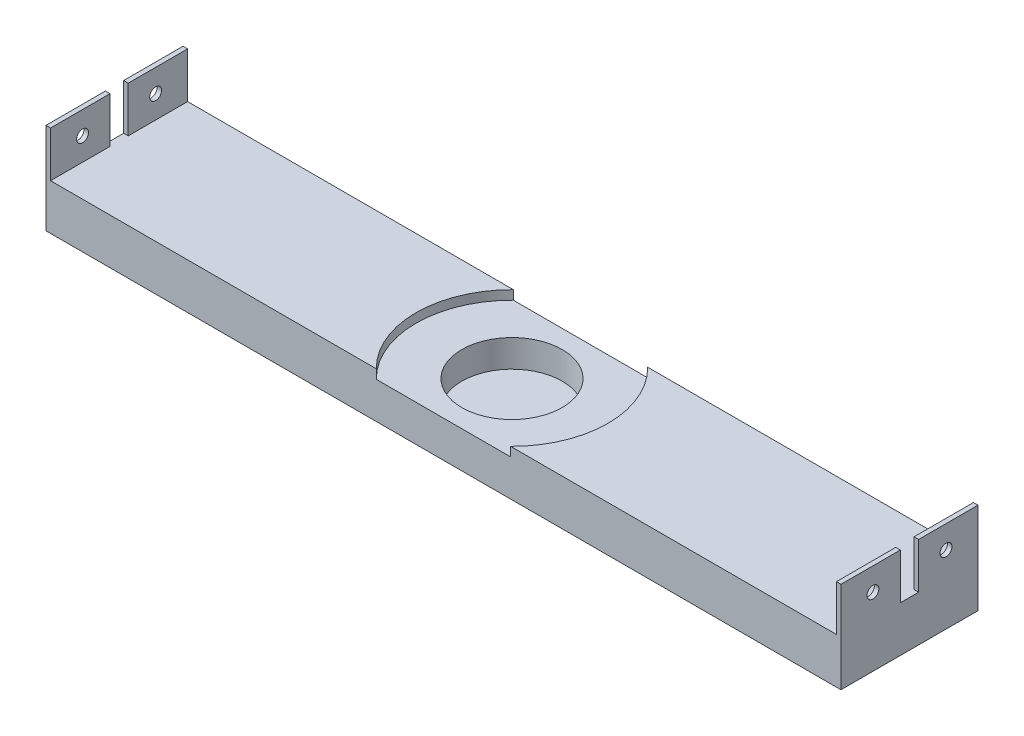
ISO-10303-21;
HEADER;
FILE_DESCRIPTION(('STEP AP214'),'2;1');
FILE_NAME('part.step','',(''),(''),'','','');
FILE_SCHEMA(('AUTOMOTIVE_DESIGN { 1 0 10303 214 1 1 1 1 }'));
ENDSEC;
DATA;
#1=APPLICATION_CONTEXT('core data for automotive mechanical design processes');
#2=APPLICATION_PROTOCOL_DEFINITION('international standard','automotive_design',2000,#1);
#3=PRODUCT_CONTEXT('',#1,'mechanical');
#4=PRODUCT('Part','Part','',(#3));
#5=PRODUCT_RELATED_PRODUCT_CATEGORY('part','',(#4));
#6=PRODUCT_DEFINITION_FORMATION('','',#4);
#7=PRODUCT_DEFINITION_CONTEXT('part definition',#1,'design');
#8=PRODUCT_DEFINITION('design','',#6,#7);
#9=PRODUCT_DEFINITION_SHAPE('','',#8);
#10=(LENGTH_UNIT() NAMED_UNIT(*) SI_UNIT(.MILLI.,.METRE.));
#11=(NAMED_UNIT(*) PLANE_ANGLE_UNIT() SI_UNIT($,.RADIAN.));
#12=(NAMED_UNIT(*) SI_UNIT($,.STERADIAN.) SOLID_ANGLE_UNIT());
#13=UNCERTAINTY_MEASURE_WITH_UNIT(LENGTH_MEASURE(1.E-05),#10,'distance_accuracy_value','');
#14=(GEOMETRIC_REPRESENTATION_CONTEXT(3) GLOBAL_UNCERTAINTY_ASSIGNED_CONTEXT((#13)) GLOBAL_UNIT_ASSIGNED_CONTEXT((#10,
#11,#12)) REPRESENTATION_CONTEXT('',''));
#15=CARTESIAN_POINT('',(0.,0.,0.));
#16=DIRECTION('',(0.,0.,1.));
#17=DIRECTION('',(1.,0.,0.));
#18=AXIS2_PLACEMENT_3D('',#15,#16,#17);
#19=CARTESIAN_POINT('',(86.,10.,30.));
#20=DIRECTION('',(0.,-1.,0.));
#21=DIRECTION('',(1.,0.,0.));
#22=AXIS2_PLACEMENT_3D('',#19,#20,#21);
#23=PLANE('',#22);
#24=DIRECTION('',(-1.,0.,0.));
#25=VECTOR('',#24,1.);
#26=CARTESIAN_POINT('',(86.,10.,30.));
#27=LINE('',#26,#25);
#28=CARTESIAN_POINT('',(-14.6969384566991,10.,30.));
#29=VERTEX_POINT('',#28);
#30=CARTESIAN_POINT('',(-86.,10.,30.));
#31=VERTEX_POINT('',#30);
#32=EDGE_CURVE('E185',#29,#31,#27,.T.);
#33=ORIENTED_EDGE('',*,*,#32,.F.);
#34=CARTESIAN_POINT('',(0.,10.,15.));
#35=DIRECTION('',(0.,1.,0.));
#36=DIRECTION('',(-1.,0.,0.));
#37=AXIS2_PLACEMENT_3D('',#34,#35,#36);
#38=CIRCLE('',#37,21.);
#39=CARTESIAN_POINT('',(-14.6969384566991,10.,0.));
#40=VERTEX_POINT('',#39);
#41=EDGE_CURVE('E169',#40,#29,#38,.T.);
#42=ORIENTED_EDGE('',*,*,#41,.F.);
#43=DIRECTION('',(-1.,0.,0.));
#44=VECTOR('',#43,1.);
#45=CARTESIAN_POINT('',(86.,10.,0.));
#46=LINE('',#45,#44);
#47=CARTESIAN_POINT('',(-86.,10.,0.));
#48=VERTEX_POINT('',#47);
#49=EDGE_CURVE('E222',#40,#48,#46,.T.);
#50=ORIENTED_EDGE('',*,*,#49,.T.);
#51=DIRECTION('',(0.,0.,-1.));
#52=VECTOR('',#51,1.);
#53=CARTESIAN_POINT('',(-86.,10.,30.));
#54=LINE('',#53,#52);
#55=CARTESIAN_POINT('',(-86.,10.,13.));
#56=VERTEX_POINT('',#55);
#57=EDGE_CURVE('E233',#56,#48,#54,.T.);
#58=ORIENTED_EDGE('',*,*,#57,.F.);
#59=DIRECTION('',(-1.,0.,0.));
#60=VECTOR('',#59,1.);
#61=CARTESIAN_POINT('',(87.,9.99999999999999,13.));
#62=LINE('',#61,#60);
#63=CARTESIAN_POINT('',(-87.,9.99999999999999,13.));
#64=VERTEX_POINT('',#63);
#65=EDGE_CURVE('E292',#56,#64,#62,.T.);
#66=ORIENTED_EDGE('',*,*,#65,.T.);
#67=DIRECTION('',(0.,0.,-1.));
#68=VECTOR('',#67,1.);
#69=CARTESIAN_POINT('',(-87.,9.99999999999999,30.));
#70=LINE('',#69,#68);
#71=CARTESIAN_POINT('',(-87.,9.99999999999999,17.));
#72=VERTEX_POINT('',#71);
#73=EDGE_CURVE('E304',#72,#64,#70,.T.);
#74=ORIENTED_EDGE('',*,*,#73,.F.);
#75=DIRECTION('',(-1.,0.,0.));
#76=VECTOR('',#75,1.);
#77=CARTESIAN_POINT('',(87.,9.99999999999999,17.));
#78=LINE('',#77,#76);
#79=CARTESIAN_POINT('',(-86.,9.99999999999999,17.));
#80=VERTEX_POINT('',#79);
#81=EDGE_CURVE('E367',#80,#72,#78,.T.);
#82=ORIENTED_EDGE('',*,*,#81,.F.);
#83=EDGE_CURVE('E192',#31,#80,#54,.T.);
#84=ORIENTED_EDGE('',*,*,#83,.F.);
#85=EDGE_LOOP('',(#33,#42,#50,#58,#66,#74,#82,#84));
#86=FACE_BOUND('',#85,.T.);
#87=ADVANCED_FACE('F33',(#86),#23,.F.);
#88=CARTESIAN_POINT('',(-86.,20.,30.));
#89=DIRECTION('',(0.,-1.,0.));
#90=DIRECTION('',(0.,0.,-1.));
#91=AXIS2_PLACEMENT_3D('',#88,#89,#90);
#92=PLANE('',#91);
#93=DIRECTION('',(0.,0.,-1.));
#94=VECTOR('',#93,1.);
#95=CARTESIAN_POINT('',(-86.,20.,30.));
#96=LINE('',#95,#94);
#97=CARTESIAN_POINT('',(-86.,20.,30.));
#98=VERTEX_POINT('',#97);
#99=CARTESIAN_POINT('',(-86.,20.,17.));
#100=VERTEX_POINT('',#99);
#101=EDGE_CURVE('E230',#98,#100,#96,.T.);
#102=ORIENTED_EDGE('',*,*,#101,.T.);
#103=DIRECTION('',(-1.,0.,0.));
#104=VECTOR('',#103,1.);
#105=CARTESIAN_POINT('',(87.,20.,17.));
#106=LINE('',#105,#104);
#107=CARTESIAN_POINT('',(-87.,20.,17.));
#108=VERTEX_POINT('',#107);
#109=EDGE_CURVE('E365',#100,#108,#106,.T.);
#110=ORIENTED_EDGE('',*,*,#109,.T.);
#111=DIRECTION('',(0.,0.,-1.));
#112=VECTOR('',#111,1.);
#113=CARTESIAN_POINT('',(-87.,20.,30.));
#114=LINE('',#113,#112);
#115=CARTESIAN_POINT('',(-87.,20.,30.));
#116=VERTEX_POINT('',#115);
#117=EDGE_CURVE('E254',#116,#108,#114,.T.);
#118=ORIENTED_EDGE('',*,*,#117,.F.);
#119=DIRECTION('',(-1.,0.,0.));
#120=VECTOR('',#119,1.);
#121=CARTESIAN_POINT('',(-86.,20.,30.));
#122=LINE('',#121,#120);
#123=EDGE_CURVE('E229',#98,#116,#122,.T.);
#124=ORIENTED_EDGE('',*,*,#123,.F.);
#125=EDGE_LOOP('',(#102,#110,#118,#124));
#126=FACE_BOUND('',#125,.T.);
#127=ADVANCED_FACE('F381',(#126),#92,.F.);
#128=CARTESIAN_POINT('',(86.,20.,30.));
#129=DIRECTION('',(0.,-1.,0.));
#130=DIRECTION('',(0.,0.,-1.));
#131=AXIS2_PLACEMENT_3D('',#128,#129,#130);
#132=PLANE('',#131);
#133=DIRECTION('',(0.,0.,-1.));
#134=VECTOR('',#133,1.);
#135=CARTESIAN_POINT('',(87.,20.,30.));
#136=LINE('',#135,#134);
#137=CARTESIAN_POINT('',(87.,20.,30.));
#138=VERTEX_POINT('',#137);
#139=CARTESIAN_POINT('',(87.,20.,17.));
#140=VERTEX_POINT('',#139);
#141=EDGE_CURVE('E244',#138,#140,#136,.T.);
#142=ORIENTED_EDGE('',*,*,#141,.T.);
#143=CARTESIAN_POINT('',(86.,20.,17.));
#144=VERTEX_POINT('',#143);
#145=EDGE_CURVE('E308',#140,#144,#106,.T.);
#146=ORIENTED_EDGE('',*,*,#145,.T.);
#147=DIRECTION('',(0.,0.,-1.));
#148=VECTOR('',#147,1.);
#149=CARTESIAN_POINT('',(86.,20.,30.));
#150=LINE('',#149,#148);
#151=CARTESIAN_POINT('',(86.,20.,30.));
#152=VERTEX_POINT('',#151);
#153=EDGE_CURVE('E240',#152,#144,#150,.T.);
#154=ORIENTED_EDGE('',*,*,#153,.F.);
#155=DIRECTION('',(-1.,0.,0.));
#156=VECTOR('',#155,1.);
#157=CARTESIAN_POINT('',(86.,20.,30.));
#158=LINE('',#157,#156);
#159=EDGE_CURVE('E199',#138,#152,#158,.T.);
#160=ORIENTED_EDGE('',*,*,#159,.F.);
#161=EDGE_LOOP('',(#142,#146,#154,#160));
#162=FACE_BOUND('',#161,.T.);
#163=ADVANCED_FACE('F349',(#162),#132,.F.);
#164=CARTESIAN_POINT('',(86.,10.,30.));
#165=DIRECTION('',(1.,0.,0.));
#166=DIRECTION('',(0.,0.,-1.));
#167=AXIS2_PLACEMENT_3D('',#164,#165,#166);
#168=PLANE('',#167);
#169=CARTESIAN_POINT('',(86.,15.,23.));
#170=DIRECTION('',(1.,0.,0.));
#171=DIRECTION('',(0.,0.,-1.));
#172=AXIS2_PLACEMENT_3D('',#169,#170,#171);
#173=CIRCLE('',#172,1.3);
#174=CARTESIAN_POINT('',(86.,15.,21.7));
#175=VERTEX_POINT('',#174);
#176=EDGE_CURVE('E261',#175,#175,#173,.T.);
#177=ORIENTED_EDGE('',*,*,#176,.T.);
#178=EDGE_LOOP('',(#177));
#179=FACE_BOUND('',#178,.T.);
#180=ORIENTED_EDGE('',*,*,#153,.T.);
#181=DIRECTION('',(0.,-1.,0.));
#182=VECTOR('',#181,1.);
#183=CARTESIAN_POINT('',(86.,10.,17.));
#184=LINE('',#183,#182);
#185=CARTESIAN_POINT('',(86.,9.99999999999999,17.));
#186=VERTEX_POINT('',#185);
#187=EDGE_CURVE('E312',#144,#186,#184,.T.);
#188=ORIENTED_EDGE('',*,*,#187,.T.);
#189=DIRECTION('',(0.,0.,-1.));
#190=VECTOR('',#189,1.);
#191=CARTESIAN_POINT('',(86.,10.,30.));
#192=LINE('',#191,#190);
#193=CARTESIAN_POINT('',(86.,10.,30.));
#194=VERTEX_POINT('',#193);
#195=EDGE_CURVE('E236',#194,#186,#192,.T.);
#196=ORIENTED_EDGE('',*,*,#195,.F.);
#197=DIRECTION('',(0.,-1.,0.));
#198=VECTOR('',#197,1.);
#199=CARTESIAN_POINT('',(86.,10.,30.));
#200=LINE('',#199,#198);
#201=EDGE_CURVE('E195',#152,#194,#200,.T.);
#202=ORIENTED_EDGE('',*,*,#201,.F.);
#203=EDGE_LOOP('',(#180,#188,#196,#202));
#204=FACE_BOUND('',#203,.T.);
#205=ADVANCED_FACE('F351',(#179,#204),#168,.F.);
#206=CARTESIAN_POINT('',(-86.,10.,30.));
#207=DIRECTION('',(-1.,0.,0.));
#208=DIRECTION('',(0.,0.,1.));
#209=AXIS2_PLACEMENT_3D('',#206,#207,#208);
#210=PLANE('',#209);
#211=CARTESIAN_POINT('',(-86.,15.,23.));
#212=DIRECTION('',(-1.,0.,0.));
#213=DIRECTION('',(0.,0.,1.));
#214=AXIS2_PLACEMENT_3D('',#211,#212,#213);
#215=CIRCLE('',#214,1.3);
#216=CARTESIAN_POINT('',(-86.,15.,24.3));
#217=VERTEX_POINT('',#216);
#218=EDGE_CURVE('E258',#217,#217,#215,.T.);
#219=ORIENTED_EDGE('',*,*,#218,.T.);
#220=EDGE_LOOP('',(#219));
#221=FACE_BOUND('',#220,.T.);
#222=ORIENTED_EDGE('',*,*,#83,.T.);
#223=DIRECTION('',(0.,1.,0.));
#224=VECTOR('',#223,1.);
#225=CARTESIAN_POINT('',(-86.,10.,17.));
#226=LINE('',#225,#224);
#227=EDGE_CURVE('E270',#80,#100,#226,.T.);
#228=ORIENTED_EDGE('',*,*,#227,.T.);
#229=ORIENTED_EDGE('',*,*,#101,.F.);
#230=DIRECTION('',(0.,1.,0.));
#231=VECTOR('',#230,1.);
#232=CARTESIAN_POINT('',(-86.,10.,30.));
#233=LINE('',#232,#231);
#234=EDGE_CURVE('E198',#31,#98,#233,.T.);
#235=ORIENTED_EDGE('',*,*,#234,.F.);
#236=EDGE_LOOP('',(#222,#228,#229,#235));
#237=FACE_BOUND('',#236,.T.);
#238=ADVANCED_FACE('F385',(#221,#237),#210,.F.);
#239=CARTESIAN_POINT('',(-87.,20.,13.));
#240=VERTEX_POINT('',#239);
#241=CARTESIAN_POINT('',(-87.,20.,0.));
#242=VERTEX_POINT('',#241);
#243=EDGE_CURVE('E253',#240,#242,#114,.T.);
#244=ORIENTED_EDGE('',*,*,#243,.F.);
#245=DIRECTION('',(-1.,0.,0.));
#246=VECTOR('',#245,1.);
#247=CARTESIAN_POINT('',(87.,20.,13.));
#248=LINE('',#247,#246);
#249=CARTESIAN_POINT('',(-86.,20.,13.));
#250=VERTEX_POINT('',#249);
#251=EDGE_CURVE('E290',#250,#240,#248,.T.);
#252=ORIENTED_EDGE('',*,*,#251,.F.);
#253=CARTESIAN_POINT('',(-86.,20.,0.));
#254=VERTEX_POINT('',#253);
#255=EDGE_CURVE('E204',#250,#254,#96,.T.);
#256=ORIENTED_EDGE('',*,*,#255,.T.);
#257=DIRECTION('',(-1.,0.,0.));
#258=VECTOR('',#257,1.);
#259=CARTESIAN_POINT('',(-86.,20.,0.));
#260=LINE('',#259,#258);
#261=EDGE_CURVE('E205',#254,#242,#260,.T.);
#262=ORIENTED_EDGE('',*,*,#261,.T.);
#263=EDGE_LOOP('',(#244,#252,#256,#262));
#264=FACE_BOUND('',#263,.T.);
#265=ADVANCED_FACE('F35',(#264),#92,.F.);
#266=CARTESIAN_POINT('',(-87.,20.,30.));
#267=DIRECTION('',(1.,0.,0.));
#268=DIRECTION('',(0.,0.,-1.));
#269=AXIS2_PLACEMENT_3D('',#266,#267,#268);
#270=PLANE('',#269);
#271=CARTESIAN_POINT('',(-87.,15.,7.));
#272=DIRECTION('',(1.,0.,0.));
#273=DIRECTION('',(0.,0.,-1.));
#274=AXIS2_PLACEMENT_3D('',#271,#272,#273);
#275=CIRCLE('',#274,1.3);
#276=CARTESIAN_POINT('',(-87.,15.,5.7));
#277=VERTEX_POINT('',#276);
#278=EDGE_CURVE('E267',#277,#277,#275,.F.);
#279=ORIENTED_EDGE('',*,*,#278,.F.);
#280=EDGE_LOOP('',(#279));
#281=FACE_BOUND('',#280,.T.);
#282=CARTESIAN_POINT('',(-87.,15.,23.));
#283=DIRECTION('',(1.,0.,0.));
#284=DIRECTION('',(0.,0.,-1.));
#285=AXIS2_PLACEMENT_3D('',#282,#283,#284);
#286=CIRCLE('',#285,1.3);
#287=CARTESIAN_POINT('',(-87.,15.,21.7));
#288=VERTEX_POINT('',#287);
#289=EDGE_CURVE('E262',#288,#288,#286,.T.);
#290=ORIENTED_EDGE('',*,*,#289,.T.);
#291=EDGE_LOOP('',(#290));
#292=FACE_BOUND('',#291,.T.);
#293=ORIENTED_EDGE('',*,*,#117,.T.);
#294=DIRECTION('',(0.,-1.,0.));
#295=VECTOR('',#294,1.);
#296=CARTESIAN_POINT('',(-87.,20.,17.));
#297=LINE('',#296,#295);
#298=EDGE_CURVE('E315',#108,#72,#297,.T.);
#299=ORIENTED_EDGE('',*,*,#298,.T.);
#300=ORIENTED_EDGE('',*,*,#73,.T.);
#301=DIRECTION('',(0.,1.,0.));
#302=VECTOR('',#301,1.);
#303=CARTESIAN_POINT('',(-87.,20.,13.));
#304=LINE('',#303,#302);
#305=EDGE_CURVE('E310',#64,#240,#304,.T.);
#306=ORIENTED_EDGE('',*,*,#305,.T.);
#307=ORIENTED_EDGE('',*,*,#243,.T.);
#308=DIRECTION('',(0.,-1.,0.));
#309=VECTOR('',#308,1.);
#310=CARTESIAN_POINT('',(-87.,20.,0.));
#311=LINE('',#310,#309);
#312=CARTESIAN_POINT('',(-87.,0.,0.));
#313=VERTEX_POINT('',#312);
#314=EDGE_CURVE('E208',#242,#313,#311,.T.);
#315=ORIENTED_EDGE('',*,*,#314,.T.);
#316=DIRECTION('',(0.,0.,-1.));
#317=VECTOR('',#316,1.);
#318=CARTESIAN_POINT('',(-87.,0.,30.));
#319=LINE('',#318,#317);
#320=CARTESIAN_POINT('',(-87.,0.,30.));
#321=VERTEX_POINT('',#320);
#322=EDGE_CURVE('E250',#321,#313,#319,.T.);
#323=ORIENTED_EDGE('',*,*,#322,.F.);
#324=DIRECTION('',(0.,-1.,0.));
#325=VECTOR('',#324,1.);
#326=CARTESIAN_POINT('',(-87.,20.,30.));
#327=LINE('',#326,#325);
#328=EDGE_CURVE('E336',#116,#321,#327,.T.);
#329=ORIENTED_EDGE('',*,*,#328,.F.);
#330=EDGE_LOOP('',(#293,#299,#300,#306,#307,#315,#323,#329));
#331=FACE_BOUND('',#330,.T.);
#332=ADVANCED_FACE('F377',(#281,#292,#331),#270,.F.);
#333=CARTESIAN_POINT('',(-87.,0.,30.));
#334=DIRECTION('',(0.,1.,0.));
#335=DIRECTION('',(-1.,0.,0.));
#336=AXIS2_PLACEMENT_3D('',#333,#334,#335);
#337=PLANE('',#336);
#338=DIRECTION('',(1.,0.,0.));
#339=VECTOR('',#338,1.);
#340=CARTESIAN_POINT('',(-87.,0.,0.));
#341=LINE('',#340,#339);
#342=CARTESIAN_POINT('',(87.,0.,0.));
#343=VERTEX_POINT('',#342);
#344=EDGE_CURVE('E211',#313,#343,#341,.T.);
#345=ORIENTED_EDGE('',*,*,#344,.T.);
#346=DIRECTION('',(0.,0.,-1.));
#347=VECTOR('',#346,1.);
#348=CARTESIAN_POINT('',(87.,0.,30.));
#349=LINE('',#348,#347);
#350=CARTESIAN_POINT('',(87.,0.,30.));
#351=VERTEX_POINT('',#350);
#352=EDGE_CURVE('E247',#351,#343,#349,.T.);
#353=ORIENTED_EDGE('',*,*,#352,.F.);
#354=DIRECTION('',(1.,0.,0.));
#355=VECTOR('',#354,1.);
#356=CARTESIAN_POINT('',(-87.,0.,30.));
#357=LINE('',#356,#355);
#358=EDGE_CURVE('E338',#321,#351,#357,.T.);
#359=ORIENTED_EDGE('',*,*,#358,.F.);
#360=ORIENTED_EDGE('',*,*,#322,.T.);
#361=EDGE_LOOP('',(#345,#353,#359,#360));
#362=FACE_BOUND('',#361,.T.);
#363=ADVANCED_FACE('F392',(#362),#337,.F.);
#364=CARTESIAN_POINT('',(87.,20.,30.));
#365=DIRECTION('',(-1.,0.,0.));
#366=DIRECTION('',(0.,0.,1.));
#367=AXIS2_PLACEMENT_3D('',#364,#365,#366);
#368=PLANE('',#367);
#369=CARTESIAN_POINT('',(87.,15.,7.));
#370=DIRECTION('',(-1.,0.,0.));
#371=DIRECTION('',(0.,0.,1.));
#372=AXIS2_PLACEMENT_3D('',#369,#370,#371);
#373=CIRCLE('',#372,1.3);
#374=CARTESIAN_POINT('',(87.,15.,8.3));
#375=VERTEX_POINT('',#374);
#376=EDGE_CURVE('E322',#375,#375,#373,.F.);
#377=ORIENTED_EDGE('',*,*,#376,.F.);
#378=EDGE_LOOP('',(#377));
#379=FACE_BOUND('',#378,.T.);
#380=CARTESIAN_POINT('',(87.,15.,23.));
#381=DIRECTION('',(-1.,0.,0.));
#382=DIRECTION('',(0.,0.,1.));
#383=AXIS2_PLACEMENT_3D('',#380,#381,#382);
#384=CIRCLE('',#383,1.3);
#385=CARTESIAN_POINT('',(87.,15.,24.3));
#386=VERTEX_POINT('',#385);
#387=EDGE_CURVE('E329',#386,#386,#384,.T.);
#388=ORIENTED_EDGE('',*,*,#387,.T.);
#389=EDGE_LOOP('',(#388));
#390=FACE_BOUND('',#389,.T.);
#391=DIRECTION('',(0.,0.,1.));
#392=VECTOR('',#391,1.);
#393=CARTESIAN_POINT('',(87.,9.99999999999999,13.));
#394=LINE('',#393,#392);
#395=CARTESIAN_POINT('',(87.,9.99999999999999,13.));
#396=VERTEX_POINT('',#395);
#397=CARTESIAN_POINT('',(87.,9.99999999999999,17.));
#398=VERTEX_POINT('',#397);
#399=EDGE_CURVE('E298',#396,#398,#394,.T.);
#400=ORIENTED_EDGE('',*,*,#399,.T.);
#401=DIRECTION('',(0.,1.,0.));
#402=VECTOR('',#401,1.);
#403=CARTESIAN_POINT('',(87.,9.99999999999999,17.));
#404=LINE('',#403,#402);
#405=EDGE_CURVE('E295',#398,#140,#404,.T.);
#406=ORIENTED_EDGE('',*,*,#405,.T.);
#407=ORIENTED_EDGE('',*,*,#141,.F.);
#408=DIRECTION('',(0.,1.,0.));
#409=VECTOR('',#408,1.);
#410=CARTESIAN_POINT('',(87.,20.,30.));
#411=LINE('',#410,#409);
#412=EDGE_CURVE('E340',#351,#138,#411,.T.);
#413=ORIENTED_EDGE('',*,*,#412,.F.);
#414=ORIENTED_EDGE('',*,*,#352,.T.);
#415=DIRECTION('',(0.,1.,0.));
#416=VECTOR('',#415,1.);
#417=CARTESIAN_POINT('',(87.,20.,0.));
#418=LINE('',#417,#416);
#419=CARTESIAN_POINT('',(87.,20.,0.));
#420=VERTEX_POINT('',#419);
#421=EDGE_CURVE('E213',#343,#420,#418,.T.);
#422=ORIENTED_EDGE('',*,*,#421,.T.);
#423=CARTESIAN_POINT('',(87.,20.,13.));
#424=VERTEX_POINT('',#423);
#425=EDGE_CURVE('E243',#424,#420,#136,.T.);
#426=ORIENTED_EDGE('',*,*,#425,.F.);
#427=DIRECTION('',(0.,-1.,0.));
#428=VECTOR('',#427,1.);
#429=CARTESIAN_POINT('',(87.,20.,13.));
#430=LINE('',#429,#428);
#431=EDGE_CURVE('E357',#424,#396,#430,.T.);
#432=ORIENTED_EDGE('',*,*,#431,.T.);
#433=EDGE_LOOP('',(#400,#406,#407,#413,#414,#422,#426,#432));
#434=FACE_BOUND('',#433,.T.);
#435=ADVANCED_FACE('F395',(#379,#390,#434),#368,.F.);
#436=CARTESIAN_POINT('',(86.,20.,13.));
#437=VERTEX_POINT('',#436);
#438=CARTESIAN_POINT('',(86.,20.,0.));
#439=VERTEX_POINT('',#438);
#440=EDGE_CURVE('E239',#437,#439,#150,.T.);
#441=ORIENTED_EDGE('',*,*,#440,.F.);
#442=EDGE_CURVE('E56',#424,#437,#248,.T.);
#443=ORIENTED_EDGE('',*,*,#442,.F.);
#444=ORIENTED_EDGE('',*,*,#425,.T.);
#445=DIRECTION('',(-1.,0.,0.));
#446=VECTOR('',#445,1.);
#447=CARTESIAN_POINT('',(86.,20.,0.));
#448=LINE('',#447,#446);
#449=EDGE_CURVE('E216',#420,#439,#448,.T.);
#450=ORIENTED_EDGE('',*,*,#449,.T.);
#451=EDGE_LOOP('',(#441,#443,#444,#450));
#452=FACE_BOUND('',#451,.T.);
#453=ADVANCED_FACE('F423',(#452),#132,.F.);
#454=CARTESIAN_POINT('',(86.,15.,7.));
#455=DIRECTION('',(1.,0.,0.));
#456=DIRECTION('',(0.,0.,-1.));
#457=AXIS2_PLACEMENT_3D('',#454,#455,#456);
#458=CIRCLE('',#457,1.3);
#459=CARTESIAN_POINT('',(86.,15.,5.7));
#460=VERTEX_POINT('',#459);
#461=EDGE_CURVE('E266',#460,#460,#458,.F.);
#462=ORIENTED_EDGE('',*,*,#461,.F.);
#463=EDGE_LOOP('',(#462));
#464=FACE_BOUND('',#463,.T.);
#465=CARTESIAN_POINT('',(86.,9.99999999999999,13.));
#466=VERTEX_POINT('',#465);
#467=CARTESIAN_POINT('',(86.,10.,0.));
#468=VERTEX_POINT('',#467);
#469=EDGE_CURVE('E235',#466,#468,#192,.T.);
#470=ORIENTED_EDGE('',*,*,#469,.F.);
#471=DIRECTION('',(0.,1.,0.));
#472=VECTOR('',#471,1.);
#473=CARTESIAN_POINT('',(86.,10.,13.));
#474=LINE('',#473,#472);
#475=EDGE_CURVE('E307',#466,#437,#474,.T.);
#476=ORIENTED_EDGE('',*,*,#475,.T.);
#477=ORIENTED_EDGE('',*,*,#440,.T.);
#478=DIRECTION('',(0.,-1.,0.));
#479=VECTOR('',#478,1.);
#480=CARTESIAN_POINT('',(86.,10.,0.));
#481=LINE('',#480,#479);
#482=EDGE_CURVE('E219',#439,#468,#481,.T.);
#483=ORIENTED_EDGE('',*,*,#482,.T.);
#484=EDGE_LOOP('',(#470,#476,#477,#483));
#485=FACE_BOUND('',#484,.T.);
#486=ADVANCED_FACE('F416',(#464,#485),#168,.F.);
#487=CARTESIAN_POINT('',(14.6969384566991,10.,0.));
#488=VERTEX_POINT('',#487);
#489=EDGE_CURVE('E223',#468,#488,#46,.T.);
#490=ORIENTED_EDGE('',*,*,#489,.T.);
#491=CARTESIAN_POINT('',(14.6969384566991,10.,30.));
#492=VERTEX_POINT('',#491);
#493=EDGE_CURVE('E179',#492,#488,#38,.T.);
#494=ORIENTED_EDGE('',*,*,#493,.F.);
#495=EDGE_CURVE('E194',#194,#492,#27,.T.);
#496=ORIENTED_EDGE('',*,*,#495,.F.);
#497=ORIENTED_EDGE('',*,*,#195,.T.);
#498=EDGE_CURVE('E366',#398,#186,#78,.T.);
#499=ORIENTED_EDGE('',*,*,#498,.F.);
#500=ORIENTED_EDGE('',*,*,#399,.F.);
#501=EDGE_CURVE('E302',#396,#466,#62,.T.);
#502=ORIENTED_EDGE('',*,*,#501,.T.);
#503=ORIENTED_EDGE('',*,*,#469,.T.);
#504=EDGE_LOOP('',(#490,#494,#496,#497,#499,#500,#502,#503));
#505=FACE_BOUND('',#504,.T.);
#506=ADVANCED_FACE('F355',(#505),#23,.F.);
#507=CARTESIAN_POINT('',(-86.,15.,7.));
#508=DIRECTION('',(-1.,0.,0.));
#509=DIRECTION('',(0.,0.,1.));
#510=AXIS2_PLACEMENT_3D('',#507,#508,#509);
#511=CIRCLE('',#510,1.3);
#512=CARTESIAN_POINT('',(-86.,15.,8.3));
#513=VERTEX_POINT('',#512);
#514=EDGE_CURVE('E263',#513,#513,#511,.F.);
#515=ORIENTED_EDGE('',*,*,#514,.F.);
#516=EDGE_LOOP('',(#515));
#517=FACE_BOUND('',#516,.T.);
#518=ORIENTED_EDGE('',*,*,#255,.F.);
#519=DIRECTION('',(0.,-1.,0.));
#520=VECTOR('',#519,1.);
#521=CARTESIAN_POINT('',(-86.,10.,13.));
#522=LINE('',#521,#520);
#523=EDGE_CURVE('E257',#250,#56,#522,.T.);
#524=ORIENTED_EDGE('',*,*,#523,.T.);
#525=ORIENTED_EDGE('',*,*,#57,.T.);
#526=DIRECTION('',(0.,1.,0.));
#527=VECTOR('',#526,1.);
#528=CARTESIAN_POINT('',(-86.,10.,0.));
#529=LINE('',#528,#527);
#530=EDGE_CURVE('E226',#48,#254,#529,.T.);
#531=ORIENTED_EDGE('',*,*,#530,.T.);
#532=EDGE_LOOP('',(#518,#524,#525,#531));
#533=FACE_BOUND('',#532,.T.);
#534=ADVANCED_FACE('F286',(#517,#533),#210,.F.);
#535=CARTESIAN_POINT('',(0.,0.,30.));
#536=DIRECTION('',(0.,0.,1.));
#537=DIRECTION('',(1.,0.,0.));
#538=AXIS2_PLACEMENT_3D('',#535,#536,#537);
#539=PLANE('',#538);
#540=DIRECTION('',(0.,1.,0.));
#541=VECTOR('',#540,1.);
#542=CARTESIAN_POINT('',(14.6969384566991,8.00000000000002,30.));
#543=LINE('',#542,#541);
#544=CARTESIAN_POINT('',(14.6969384566991,8.00000000000002,30.));
#545=VERTEX_POINT('',#544);
#546=EDGE_CURVE('E188',#545,#492,#543,.T.);
#547=ORIENTED_EDGE('',*,*,#546,.F.);
#548=DIRECTION('',(-1.,0.,0.));
#549=VECTOR('',#548,1.);
#550=CARTESIAN_POINT('',(0.,8.00000000000002,30.));
#551=LINE('',#550,#549);
#552=CARTESIAN_POINT('',(-14.6969384566991,8.00000000000002,30.));
#553=VERTEX_POINT('',#552);
#554=EDGE_CURVE('E187',#545,#553,#551,.T.);
#555=ORIENTED_EDGE('',*,*,#554,.T.);
#556=DIRECTION('',(0.,1.,0.));
#557=VECTOR('',#556,1.);
#558=CARTESIAN_POINT('',(-14.6969384566991,8.00000000000002,30.));
#559=LINE('',#558,#557);
#560=EDGE_CURVE('E173',#29,#553,#559,.F.);
#561=ORIENTED_EDGE('',*,*,#560,.F.);
#562=ORIENTED_EDGE('',*,*,#32,.T.);
#563=ORIENTED_EDGE('',*,*,#234,.T.);
#564=ORIENTED_EDGE('',*,*,#123,.T.);
#565=ORIENTED_EDGE('',*,*,#328,.T.);
#566=ORIENTED_EDGE('',*,*,#358,.T.);
#567=ORIENTED_EDGE('',*,*,#412,.T.);
#568=ORIENTED_EDGE('',*,*,#159,.T.);
#569=ORIENTED_EDGE('',*,*,#201,.T.);
#570=ORIENTED_EDGE('',*,*,#495,.T.);
#571=EDGE_LOOP('',(#547,#555,#561,#562,#563,#564,#565,#566,#567,#568,#569,#570));
#572=FACE_BOUND('',#571,.T.);
#573=ADVANCED_FACE('F184',(#572),#539,.T.);
#574=CARTESIAN_POINT('',(0.,0.,0.));
#575=DIRECTION('',(0.,0.,1.));
#576=DIRECTION('',(1.,0.,0.));
#577=AXIS2_PLACEMENT_3D('',#574,#575,#576);
#578=PLANE('',#577);
#579=DIRECTION('',(-1.,0.,0.));
#580=VECTOR('',#579,1.);
#581=CARTESIAN_POINT('',(0.,8.00000000000002,0.));
#582=LINE('',#581,#580);
#583=CARTESIAN_POINT('',(14.6969384566991,8.00000000000002,0.));
#584=VERTEX_POINT('',#583);
#585=CARTESIAN_POINT('',(-14.6969384566991,8.00000000000002,0.));
#586=VERTEX_POINT('',#585);
#587=EDGE_CURVE('E275',#584,#586,#582,.T.);
#588=ORIENTED_EDGE('',*,*,#587,.F.);
#589=DIRECTION('',(0.,1.,0.));
#590=VECTOR('',#589,1.);
#591=CARTESIAN_POINT('',(14.6969384566991,8.00000000000002,0.));
#592=LINE('',#591,#590);
#593=EDGE_CURVE('E11',#584,#488,#592,.T.);
#594=ORIENTED_EDGE('',*,*,#593,.T.);
#595=ORIENTED_EDGE('',*,*,#489,.F.);
#596=ORIENTED_EDGE('',*,*,#482,.F.);
#597=ORIENTED_EDGE('',*,*,#449,.F.);
#598=ORIENTED_EDGE('',*,*,#421,.F.);
#599=ORIENTED_EDGE('',*,*,#344,.F.);
#600=ORIENTED_EDGE('',*,*,#314,.F.);
#601=ORIENTED_EDGE('',*,*,#261,.F.);
#602=ORIENTED_EDGE('',*,*,#530,.F.);
#603=ORIENTED_EDGE('',*,*,#49,.F.);
#604=DIRECTION('',(0.,1.,0.));
#605=VECTOR('',#604,1.);
#606=CARTESIAN_POINT('',(-14.6969384566991,8.00000000000002,0.));
#607=LINE('',#606,#605);
#608=EDGE_CURVE('E41',#40,#586,#607,.F.);
#609=ORIENTED_EDGE('',*,*,#608,.T.);
#610=EDGE_LOOP('',(#588,#594,#595,#596,#597,#598,#599,#600,#601,#602,#603,#609));
#611=FACE_BOUND('',#610,.T.);
#612=ADVANCED_FACE('F278',(#611),#578,.F.);
#613=CARTESIAN_POINT('',(-87.,15.,23.));
#614=DIRECTION('',(1.,0.,0.));
#615=DIRECTION('',(0.,0.,-1.));
#616=AXIS2_PLACEMENT_3D('',#613,#614,#615);
#617=CYLINDRICAL_SURFACE('',#616,1.3);
#618=ORIENTED_EDGE('',*,*,#289,.F.);
#619=EDGE_LOOP('',(#618));
#620=FACE_BOUND('',#619,.T.);
#621=ORIENTED_EDGE('',*,*,#218,.F.);
#622=EDGE_LOOP('',(#621));
#623=FACE_BOUND('',#622,.T.);
#624=ADVANCED_FACE('F445',(#620,#623),#617,.F.);
#625=ORIENTED_EDGE('',*,*,#176,.F.);
#626=EDGE_LOOP('',(#625));
#627=FACE_BOUND('',#626,.T.);
#628=ORIENTED_EDGE('',*,*,#387,.F.);
#629=EDGE_LOOP('',(#628));
#630=FACE_BOUND('',#629,.T.);
#631=ADVANCED_FACE('F441',(#627,#630),#617,.F.);
#632=CARTESIAN_POINT('',(-87.,15.,7.));
#633=DIRECTION('',(1.,0.,0.));
#634=DIRECTION('',(0.,0.,-1.));
#635=AXIS2_PLACEMENT_3D('',#632,#633,#634);
#636=CYLINDRICAL_SURFACE('',#635,1.3);
#637=ORIENTED_EDGE('',*,*,#278,.T.);
#638=EDGE_LOOP('',(#637));
#639=FACE_BOUND('',#638,.T.);
#640=ORIENTED_EDGE('',*,*,#514,.T.);
#641=EDGE_LOOP('',(#640));
#642=FACE_BOUND('',#641,.T.);
#643=ADVANCED_FACE('F444',(#639,#642),#636,.F.);
#644=ORIENTED_EDGE('',*,*,#461,.T.);
#645=EDGE_LOOP('',(#644));
#646=FACE_BOUND('',#645,.T.);
#647=ORIENTED_EDGE('',*,*,#376,.T.);
#648=EDGE_LOOP('',(#647));
#649=FACE_BOUND('',#648,.T.);
#650=ADVANCED_FACE('F476',(#646,#649),#636,.F.);
#651=CARTESIAN_POINT('',(87.,20.,13.));
#652=DIRECTION('',(0.,0.,-1.));
#653=DIRECTION('',(0.,1.,0.));
#654=AXIS2_PLACEMENT_3D('',#651,#652,#653);
#655=PLANE('',#654);
#656=ORIENTED_EDGE('',*,*,#65,.F.);
#657=ORIENTED_EDGE('',*,*,#523,.F.);
#658=ORIENTED_EDGE('',*,*,#251,.T.);
#659=ORIENTED_EDGE('',*,*,#305,.F.);
#660=EDGE_LOOP('',(#656,#657,#658,#659));
#661=FACE_BOUND('',#660,.T.);
#662=ADVANCED_FACE('F289',(#661),#655,.F.);
#663=CARTESIAN_POINT('',(87.,9.99999999999999,17.));
#664=DIRECTION('',(0.,0.,1.));
#665=DIRECTION('',(1.,0.,0.));
#666=AXIS2_PLACEMENT_3D('',#663,#664,#665);
#667=PLANE('',#666);
#668=ORIENTED_EDGE('',*,*,#109,.F.);
#669=ORIENTED_EDGE('',*,*,#227,.F.);
#670=ORIENTED_EDGE('',*,*,#81,.T.);
#671=ORIENTED_EDGE('',*,*,#298,.F.);
#672=EDGE_LOOP('',(#668,#669,#670,#671));
#673=FACE_BOUND('',#672,.T.);
#674=ADVANCED_FACE('F379',(#673),#667,.F.);
#675=ORIENTED_EDGE('',*,*,#145,.F.);
#676=ORIENTED_EDGE('',*,*,#405,.F.);
#677=ORIENTED_EDGE('',*,*,#498,.T.);
#678=ORIENTED_EDGE('',*,*,#187,.F.);
#679=EDGE_LOOP('',(#675,#676,#677,#678));
#680=FACE_BOUND('',#679,.T.);
#681=ADVANCED_FACE('F396',(#680),#667,.F.);
#682=ORIENTED_EDGE('',*,*,#501,.F.);
#683=ORIENTED_EDGE('',*,*,#431,.F.);
#684=ORIENTED_EDGE('',*,*,#442,.T.);
#685=ORIENTED_EDGE('',*,*,#475,.F.);
#686=EDGE_LOOP('',(#682,#683,#684,#685));
#687=FACE_BOUND('',#686,.T.);
#688=ADVANCED_FACE('F398',(#687),#655,.F.);
#689=CARTESIAN_POINT('',(0.,8.00000000000002,15.));
#690=DIRECTION('',(0.,1.,0.));
#691=DIRECTION('',(-1.,0.,0.));
#692=AXIS2_PLACEMENT_3D('',#689,#690,#691);
#693=CYLINDRICAL_SURFACE('',#692,21.);
#694=ORIENTED_EDGE('',*,*,#546,.T.);
#695=ORIENTED_EDGE('',*,*,#493,.T.);
#696=ORIENTED_EDGE('',*,*,#593,.F.);
#697=CARTESIAN_POINT('',(0.,8.00000000000002,15.));
#698=DIRECTION('',(0.,1.,0.));
#699=DIRECTION('',(-1.,0.,0.));
#700=AXIS2_PLACEMENT_3D('',#697,#698,#699);
#701=CIRCLE('',#700,21.);
#702=EDGE_CURVE('E48',#545,#584,#701,.T.);
#703=ORIENTED_EDGE('',*,*,#702,.F.);
#704=EDGE_LOOP('',(#694,#695,#696,#703));
#705=FACE_BOUND('',#704,.T.);
#706=ADVANCED_FACE('F404',(#705),#693,.F.);
#707=ORIENTED_EDGE('',*,*,#560,.T.);
#708=EDGE_CURVE('E662',#586,#553,#701,.T.);
#709=ORIENTED_EDGE('',*,*,#708,.F.);
#710=ORIENTED_EDGE('',*,*,#608,.F.);
#711=ORIENTED_EDGE('',*,*,#41,.T.);
#712=EDGE_LOOP('',(#707,#709,#710,#711));
#713=FACE_BOUND('',#712,.T.);
#714=ADVANCED_FACE('F171',(#713),#693,.F.);
#715=CARTESIAN_POINT('',(0.,8.00000000000002,15.));
#716=DIRECTION('',(0.,1.,0.));
#717=DIRECTION('',(-1.,0.,0.));
#718=AXIS2_PLACEMENT_3D('',#715,#716,#717);
#719=PLANE('',#718);
#720=CARTESIAN_POINT('',(0.,8.00000000000002,15.));
#721=DIRECTION('',(0.,1.,0.));
#722=DIRECTION('',(-1.,0.,0.));
#723=AXIS2_PLACEMENT_3D('',#720,#721,#722);
#724=CIRCLE('',#723,11.);
#725=CARTESIAN_POINT('',(-11.,8.00000000000002,15.));
#726=VERTEX_POINT('',#725);
#727=EDGE_CURVE('E273',#726,#726,#724,.F.);
#728=ORIENTED_EDGE('',*,*,#727,.T.);
#729=EDGE_LOOP('',(#728));
#730=FACE_BOUND('',#729,.T.);
#731=ORIENTED_EDGE('',*,*,#702,.T.);
#732=ORIENTED_EDGE('',*,*,#587,.T.);
#733=ORIENTED_EDGE('',*,*,#708,.T.);
#734=ORIENTED_EDGE('',*,*,#554,.F.);
#735=EDGE_LOOP('',(#731,#732,#733,#734));
#736=FACE_BOUND('',#735,.T.);
#737=ADVANCED_FACE('F480',(#730,#736),#719,.T.);
#738=CARTESIAN_POINT('',(0.,2.00000000000002,15.));
#739=DIRECTION('',(0.,1.,0.));
#740=DIRECTION('',(-1.,0.,0.));
#741=AXIS2_PLACEMENT_3D('',#738,#739,#740);
#742=PLANE('',#741);
#743=CARTESIAN_POINT('',(0.,2.00000000000002,15.));
#744=DIRECTION('',(0.,1.,0.));
#745=DIRECTION('',(-1.,0.,0.));
#746=AXIS2_PLACEMENT_3D('',#743,#744,#745);
#747=CIRCLE('',#746,11.);
#748=CARTESIAN_POINT('',(-11.,2.00000000000002,15.));
#749=VERTEX_POINT('',#748);
#750=EDGE_CURVE('E209',#749,#749,#747,.T.);
#751=ORIENTED_EDGE('',*,*,#750,.T.);
#752=EDGE_LOOP('',(#751));
#753=FACE_BOUND('',#752,.T.);
#754=ADVANCED_FACE('F477',(#753),#742,.T.);
#755=CARTESIAN_POINT('',(0.,2.00000000000002,15.));
#756=DIRECTION('',(0.,1.,0.));
#757=DIRECTION('',(-1.,0.,0.));
#758=AXIS2_PLACEMENT_3D('',#755,#756,#757);
#759=CYLINDRICAL_SURFACE('',#758,11.);
#760=ORIENTED_EDGE('',*,*,#750,.F.);
#761=EDGE_LOOP('',(#760));
#762=FACE_BOUND('',#761,.T.);
#763=ORIENTED_EDGE('',*,*,#727,.F.);
#764=EDGE_LOOP('',(#763));
#765=FACE_BOUND('',#764,.T.);
#766=ADVANCED_FACE('F479',(#762,#765),#759,.F.);
#767=CLOSED_SHELL('',(#87,#127,#163,#205,#238,#265,#332,#363,#435,#453,#486,#506,#534,#573,#612,
#624,#631,#643,#650,#662,#674,#681,#688,#706,#714,#737,#754,#766));
#768=MANIFOLD_SOLID_BREP('B2',#767);
#769=ADVANCED_BREP_SHAPE_REPRESENTATION('',(#18,#768),#14);
#770=SHAPE_DEFINITION_REPRESENTATION(#9,#769);
ENDSEC;
END-ISO-10303-21;
